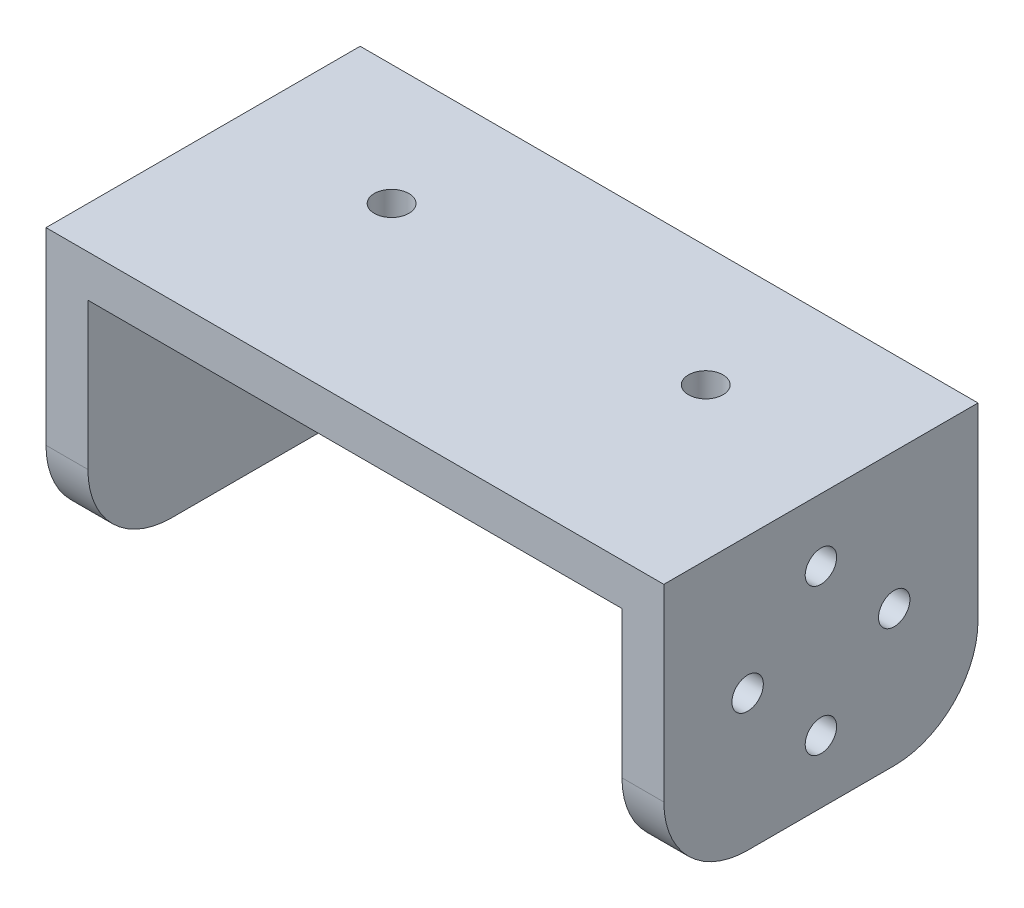
ISO-10303-21;
HEADER;
FILE_DESCRIPTION(('STEP AP214'),'2;1');
FILE_NAME('part.step','',(''),(''),'','','');
FILE_SCHEMA(('AUTOMOTIVE_DESIGN { 1 0 10303 214 1 1 1 1 }'));
ENDSEC;
DATA;
#1=APPLICATION_CONTEXT('core data for automotive mechanical design processes');
#2=APPLICATION_PROTOCOL_DEFINITION('international standard','automotive_design',2000,#1);
#3=PRODUCT_CONTEXT('',#1,'mechanical');
#4=PRODUCT('Part','Part','',(#3));
#5=PRODUCT_RELATED_PRODUCT_CATEGORY('part','',(#4));
#6=PRODUCT_DEFINITION_FORMATION('','',#4);
#7=PRODUCT_DEFINITION_CONTEXT('part definition',#1,'design');
#8=PRODUCT_DEFINITION('design','',#6,#7);
#9=PRODUCT_DEFINITION_SHAPE('','',#8);
#10=(LENGTH_UNIT() NAMED_UNIT(*) SI_UNIT(.MILLI.,.METRE.));
#11=(NAMED_UNIT(*) PLANE_ANGLE_UNIT() SI_UNIT($,.RADIAN.));
#12=(NAMED_UNIT(*) SI_UNIT($,.STERADIAN.) SOLID_ANGLE_UNIT());
#13=UNCERTAINTY_MEASURE_WITH_UNIT(LENGTH_MEASURE(1.E-05),#10,'distance_accuracy_value','');
#14=(GEOMETRIC_REPRESENTATION_CONTEXT(3) GLOBAL_UNCERTAINTY_ASSIGNED_CONTEXT((#13)) GLOBAL_UNIT_ASSIGNED_CONTEXT((#10,
#11,#12)) REPRESENTATION_CONTEXT('',''));
#15=CARTESIAN_POINT('',(0.,0.,0.));
#16=DIRECTION('',(0.,0.,1.));
#17=DIRECTION('',(1.,0.,0.));
#18=AXIS2_PLACEMENT_3D('',#15,#16,#17);
#19=CARTESIAN_POINT('',(29.5,0.,30.));
#20=DIRECTION('',(-1.,0.,0.));
#21=DIRECTION('',(0.,0.,1.));
#22=AXIS2_PLACEMENT_3D('',#19,#20,#21);
#23=PLANE('',#22);
#24=CARTESIAN_POINT('',(29.5,-13.,8.));
#25=DIRECTION('',(1.,0.,0.));
#26=DIRECTION('',(0.,0.,-1.));
#27=AXIS2_PLACEMENT_3D('',#24,#25,#26);
#28=CIRCLE('',#27,1.5);
#29=CARTESIAN_POINT('',(29.5,-13.,6.5));
#30=VERTEX_POINT('',#29);
#31=EDGE_CURVE('E207',#30,#30,#28,.T.);
#32=ORIENTED_EDGE('',*,*,#31,.F.);
#33=EDGE_LOOP('',(#32));
#34=FACE_BOUND('',#33,.T.);
#35=CARTESIAN_POINT('',(29.5,-20.,15.));
#36=DIRECTION('',(1.,0.,0.));
#37=DIRECTION('',(0.,0.,-1.));
#38=AXIS2_PLACEMENT_3D('',#35,#36,#37);
#39=CIRCLE('',#38,1.5);
#40=CARTESIAN_POINT('',(29.5,-20.,13.5));
#41=VERTEX_POINT('',#40);
#42=EDGE_CURVE('E470',#41,#41,#39,.T.);
#43=ORIENTED_EDGE('',*,*,#42,.F.);
#44=EDGE_LOOP('',(#43));
#45=FACE_BOUND('',#44,.T.);
#46=CARTESIAN_POINT('',(29.5,-13.,22.));
#47=DIRECTION('',(1.,0.,0.));
#48=DIRECTION('',(0.,0.,-1.));
#49=AXIS2_PLACEMENT_3D('',#46,#47,#48);
#50=CIRCLE('',#49,1.5);
#51=CARTESIAN_POINT('',(29.5,-13.,20.5));
#52=VERTEX_POINT('',#51);
#53=EDGE_CURVE('E473',#52,#52,#50,.T.);
#54=ORIENTED_EDGE('',*,*,#53,.F.);
#55=EDGE_LOOP('',(#54));
#56=FACE_BOUND('',#55,.T.);
#57=CARTESIAN_POINT('',(29.5,-6.,15.));
#58=DIRECTION('',(1.,0.,0.));
#59=DIRECTION('',(0.,0.,-1.));
#60=AXIS2_PLACEMENT_3D('',#57,#58,#59);
#61=CIRCLE('',#60,1.5);
#62=CARTESIAN_POINT('',(29.5,-6.,13.5));
#63=VERTEX_POINT('',#62);
#64=EDGE_CURVE('E222',#63,#63,#61,.T.);
#65=ORIENTED_EDGE('',*,*,#64,.F.);
#66=EDGE_LOOP('',(#65));
#67=FACE_BOUND('',#66,.T.);
#68=DIRECTION('',(0.,0.,-1.));
#69=VECTOR('',#68,1.);
#70=CARTESIAN_POINT('',(29.5,-26.,30.));
#71=LINE('',#70,#69);
#72=CARTESIAN_POINT('',(29.5,-26.,22.));
#73=VERTEX_POINT('',#72);
#74=CARTESIAN_POINT('',(29.5,-26.,8.));
#75=VERTEX_POINT('',#74);
#76=EDGE_CURVE('E235',#73,#75,#71,.T.);
#77=ORIENTED_EDGE('',*,*,#76,.T.);
#78=CARTESIAN_POINT('',(29.5,-18.,8.));
#79=DIRECTION('',(-1.,0.,0.));
#80=DIRECTION('',(0.,0.,1.));
#81=AXIS2_PLACEMENT_3D('',#78,#79,#80);
#82=CIRCLE('',#81,8.);
#83=CARTESIAN_POINT('',(29.5,-18.,0.));
#84=VERTEX_POINT('',#83);
#85=EDGE_CURVE('E188',#75,#84,#82,.F.);
#86=ORIENTED_EDGE('',*,*,#85,.T.);
#87=DIRECTION('',(0.,1.,0.));
#88=VECTOR('',#87,1.);
#89=CARTESIAN_POINT('',(29.5,0.,0.));
#90=LINE('',#89,#88);
#91=CARTESIAN_POINT('',(29.5,0.,0.));
#92=VERTEX_POINT('',#91);
#93=EDGE_CURVE('E154',#84,#92,#90,.T.);
#94=ORIENTED_EDGE('',*,*,#93,.T.);
#95=DIRECTION('',(0.,0.,-1.));
#96=VECTOR('',#95,1.);
#97=CARTESIAN_POINT('',(29.5,0.,30.));
#98=LINE('',#97,#96);
#99=CARTESIAN_POINT('',(29.5,0.,30.));
#100=VERTEX_POINT('',#99);
#101=EDGE_CURVE('E146',#100,#92,#98,.T.);
#102=ORIENTED_EDGE('',*,*,#101,.F.);
#103=DIRECTION('',(0.,1.,0.));
#104=VECTOR('',#103,1.);
#105=CARTESIAN_POINT('',(29.5,0.,30.));
#106=LINE('',#105,#104);
#107=CARTESIAN_POINT('',(29.5,-18.,30.));
#108=VERTEX_POINT('',#107);
#109=EDGE_CURVE('E130',#108,#100,#106,.T.);
#110=ORIENTED_EDGE('',*,*,#109,.F.);
#111=CARTESIAN_POINT('',(29.5,-18.,22.));
#112=DIRECTION('',(-1.,0.,0.));
#113=DIRECTION('',(0.,0.,1.));
#114=AXIS2_PLACEMENT_3D('',#111,#112,#113);
#115=CIRCLE('',#114,8.);
#116=EDGE_CURVE('E186',#108,#73,#115,.F.);
#117=ORIENTED_EDGE('',*,*,#116,.T.);
#118=EDGE_LOOP('',(#77,#86,#94,#102,#110,#117));
#119=FACE_BOUND('',#118,.T.);
#120=ADVANCED_FACE('F39',(#34,#45,#56,#67,#119),#23,.F.);
#121=CARTESIAN_POINT('',(0.,0.,30.));
#122=DIRECTION('',(0.,-1.,0.));
#123=DIRECTION('',(1.,0.,0.));
#124=AXIS2_PLACEMENT_3D('',#121,#122,#123);
#125=PLANE('',#124);
#126=CARTESIAN_POINT('',(15.,0.,11.5));
#127=DIRECTION('',(0.,1.,0.));
#128=DIRECTION('',(-1.,0.,0.));
#129=AXIS2_PLACEMENT_3D('',#126,#127,#128);
#130=CIRCLE('',#129,1.65000000000001);
#131=CARTESIAN_POINT('',(13.35,0.,11.5));
#132=VERTEX_POINT('',#131);
#133=EDGE_CURVE('E195',#132,#132,#130,.T.);
#134=ORIENTED_EDGE('',*,*,#133,.F.);
#135=EDGE_LOOP('',(#134));
#136=FACE_BOUND('',#135,.T.);
#137=CARTESIAN_POINT('',(-15.,0.,11.5));
#138=DIRECTION('',(0.,1.,0.));
#139=DIRECTION('',(-1.,0.,0.));
#140=AXIS2_PLACEMENT_3D('',#137,#138,#139);
#141=CIRCLE('',#140,1.65);
#142=CARTESIAN_POINT('',(-16.65,0.,11.5));
#143=VERTEX_POINT('',#142);
#144=EDGE_CURVE('E201',#143,#143,#141,.T.);
#145=ORIENTED_EDGE('',*,*,#144,.F.);
#146=EDGE_LOOP('',(#145));
#147=FACE_BOUND('',#146,.T.);
#148=DIRECTION('',(-1.,0.,0.));
#149=VECTOR('',#148,1.);
#150=CARTESIAN_POINT('',(0.,0.,0.));
#151=LINE('',#150,#149);
#152=CARTESIAN_POINT('',(-29.5,0.,0.));
#153=VERTEX_POINT('',#152);
#154=EDGE_CURVE('E237',#92,#153,#151,.T.);
#155=ORIENTED_EDGE('',*,*,#154,.T.);
#156=DIRECTION('',(0.,0.,-1.));
#157=VECTOR('',#156,1.);
#158=CARTESIAN_POINT('',(-29.5,0.,30.));
#159=LINE('',#158,#157);
#160=CARTESIAN_POINT('',(-29.5,0.,30.));
#161=VERTEX_POINT('',#160);
#162=EDGE_CURVE('E148',#161,#153,#159,.T.);
#163=ORIENTED_EDGE('',*,*,#162,.F.);
#164=DIRECTION('',(-1.,0.,0.));
#165=VECTOR('',#164,1.);
#166=CARTESIAN_POINT('',(0.,0.,30.));
#167=LINE('',#166,#165);
#168=EDGE_CURVE('E134',#100,#161,#167,.T.);
#169=ORIENTED_EDGE('',*,*,#168,.F.);
#170=ORIENTED_EDGE('',*,*,#101,.T.);
#171=EDGE_LOOP('',(#155,#163,#169,#170));
#172=FACE_BOUND('',#171,.T.);
#173=ADVANCED_FACE('F145',(#136,#147,#172),#125,.F.);
#174=CARTESIAN_POINT('',(-29.5,0.,30.));
#175=DIRECTION('',(1.,0.,0.));
#176=DIRECTION('',(0.,1.,0.));
#177=AXIS2_PLACEMENT_3D('',#174,#175,#176);
#178=PLANE('',#177);
#179=CARTESIAN_POINT('',(-29.5,-13.,15.));
#180=DIRECTION('',(-1.,0.,0.));
#181=DIRECTION('',(0.,-1.,0.));
#182=AXIS2_PLACEMENT_3D('',#179,#180,#181);
#183=CIRCLE('',#182,1.65);
#184=CARTESIAN_POINT('',(-29.5,-14.65,15.));
#185=VERTEX_POINT('',#184);
#186=EDGE_CURVE('E202',#185,#185,#183,.T.);
#187=ORIENTED_EDGE('',*,*,#186,.F.);
#188=EDGE_LOOP('',(#187));
#189=FACE_BOUND('',#188,.T.);
#190=DIRECTION('',(0.,0.,-1.));
#191=VECTOR('',#190,1.);
#192=CARTESIAN_POINT('',(-29.5,-26.,30.));
#193=LINE('',#192,#191);
#194=CARTESIAN_POINT('',(-29.5,-26.,22.));
#195=VERTEX_POINT('',#194);
#196=CARTESIAN_POINT('',(-29.5,-26.,8.));
#197=VERTEX_POINT('',#196);
#198=EDGE_CURVE('E159',#195,#197,#193,.T.);
#199=ORIENTED_EDGE('',*,*,#198,.F.);
#200=CARTESIAN_POINT('',(-29.5,-18.,22.));
#201=DIRECTION('',(1.,0.,0.));
#202=DIRECTION('',(0.,1.,0.));
#203=AXIS2_PLACEMENT_3D('',#200,#201,#202);
#204=CIRCLE('',#203,8.);
#205=CARTESIAN_POINT('',(-29.5,-18.,30.));
#206=VERTEX_POINT('',#205);
#207=EDGE_CURVE('E176',#195,#206,#204,.F.);
#208=ORIENTED_EDGE('',*,*,#207,.T.);
#209=DIRECTION('',(0.,-1.,0.));
#210=VECTOR('',#209,1.);
#211=CARTESIAN_POINT('',(-29.5,0.,30.));
#212=LINE('',#211,#210);
#213=EDGE_CURVE('E150',#161,#206,#212,.T.);
#214=ORIENTED_EDGE('',*,*,#213,.F.);
#215=ORIENTED_EDGE('',*,*,#162,.T.);
#216=DIRECTION('',(0.,-1.,0.));
#217=VECTOR('',#216,1.);
#218=CARTESIAN_POINT('',(-29.5,0.,0.));
#219=LINE('',#218,#217);
#220=CARTESIAN_POINT('',(-29.5,-18.,0.));
#221=VERTEX_POINT('',#220);
#222=EDGE_CURVE('E239',#153,#221,#219,.T.);
#223=ORIENTED_EDGE('',*,*,#222,.T.);
#224=CARTESIAN_POINT('',(-29.5,-18.,8.));
#225=DIRECTION('',(1.,0.,0.));
#226=DIRECTION('',(0.,1.,0.));
#227=AXIS2_PLACEMENT_3D('',#224,#225,#226);
#228=CIRCLE('',#227,8.);
#229=EDGE_CURVE('E174',#221,#197,#228,.F.);
#230=ORIENTED_EDGE('',*,*,#229,.T.);
#231=EDGE_LOOP('',(#199,#208,#214,#215,#223,#230));
#232=FACE_BOUND('',#231,.T.);
#233=ADVANCED_FACE('F288',(#189,#232),#178,.F.);
#234=CARTESIAN_POINT('',(-25.5,-26.,30.));
#235=DIRECTION('',(0.,1.,0.));
#236=DIRECTION('',(0.,0.,1.));
#237=AXIS2_PLACEMENT_3D('',#234,#235,#236);
#238=PLANE('',#237);
#239=DIRECTION('',(0.,0.,-1.));
#240=VECTOR('',#239,1.);
#241=CARTESIAN_POINT('',(-25.5,-26.,30.));
#242=LINE('',#241,#240);
#243=CARTESIAN_POINT('',(-25.5,-26.,22.));
#244=VERTEX_POINT('',#243);
#245=CARTESIAN_POINT('',(-25.5,-26.,8.));
#246=VERTEX_POINT('',#245);
#247=EDGE_CURVE('E256',#244,#246,#242,.T.);
#248=ORIENTED_EDGE('',*,*,#247,.F.);
#249=DIRECTION('',(1.,0.,0.));
#250=VECTOR('',#249,1.);
#251=CARTESIAN_POINT('',(-29.5,-26.,22.));
#252=LINE('',#251,#250);
#253=EDGE_CURVE('E172',#244,#195,#252,.F.);
#254=ORIENTED_EDGE('',*,*,#253,.T.);
#255=ORIENTED_EDGE('',*,*,#198,.T.);
#256=DIRECTION('',(1.,0.,0.));
#257=VECTOR('',#256,1.);
#258=CARTESIAN_POINT('',(-25.5,-26.,8.));
#259=LINE('',#258,#257);
#260=EDGE_CURVE('E169',#197,#246,#259,.T.);
#261=ORIENTED_EDGE('',*,*,#260,.T.);
#262=EDGE_LOOP('',(#248,#254,#255,#261));
#263=FACE_BOUND('',#262,.T.);
#264=ADVANCED_FACE('F263',(#263),#238,.F.);
#265=CARTESIAN_POINT('',(-25.5,-4.00000000000001,30.));
#266=DIRECTION('',(-1.,0.,0.));
#267=DIRECTION('',(0.,0.,1.));
#268=AXIS2_PLACEMENT_3D('',#265,#266,#267);
#269=PLANE('',#268);
#270=CARTESIAN_POINT('',(-25.5,-13.,15.));
#271=DIRECTION('',(-1.,0.,0.));
#272=DIRECTION('',(0.,0.,1.));
#273=AXIS2_PLACEMENT_3D('',#270,#271,#272);
#274=CIRCLE('',#273,1.65);
#275=CARTESIAN_POINT('',(-25.5,-13.,16.65));
#276=VERTEX_POINT('',#275);
#277=EDGE_CURVE('E198',#276,#276,#274,.T.);
#278=ORIENTED_EDGE('',*,*,#277,.T.);
#279=EDGE_LOOP('',(#278));
#280=FACE_BOUND('',#279,.T.);
#281=DIRECTION('',(0.,1.,0.));
#282=VECTOR('',#281,1.);
#283=CARTESIAN_POINT('',(-25.5,-4.00000000000001,30.));
#284=LINE('',#283,#282);
#285=CARTESIAN_POINT('',(-25.5,-18.,30.));
#286=VERTEX_POINT('',#285);
#287=CARTESIAN_POINT('',(-25.5,-4.00000000000001,30.));
#288=VERTEX_POINT('',#287);
#289=EDGE_CURVE('E229',#286,#288,#284,.T.);
#290=ORIENTED_EDGE('',*,*,#289,.F.);
#291=CARTESIAN_POINT('',(-25.5,-18.,22.));
#292=DIRECTION('',(-1.,0.,0.));
#293=DIRECTION('',(0.,0.,1.));
#294=AXIS2_PLACEMENT_3D('',#291,#292,#293);
#295=CIRCLE('',#294,8.);
#296=EDGE_CURVE('E167',#286,#244,#295,.F.);
#297=ORIENTED_EDGE('',*,*,#296,.T.);
#298=ORIENTED_EDGE('',*,*,#247,.T.);
#299=CARTESIAN_POINT('',(-25.5,-18.,8.));
#300=DIRECTION('',(-1.,0.,0.));
#301=DIRECTION('',(0.,0.,1.));
#302=AXIS2_PLACEMENT_3D('',#299,#300,#301);
#303=CIRCLE('',#302,8.);
#304=CARTESIAN_POINT('',(-25.5,-18.,0.));
#305=VERTEX_POINT('',#304);
#306=EDGE_CURVE('E165',#246,#305,#303,.F.);
#307=ORIENTED_EDGE('',*,*,#306,.T.);
#308=DIRECTION('',(0.,1.,0.));
#309=VECTOR('',#308,1.);
#310=CARTESIAN_POINT('',(-25.5,-4.00000000000001,0.));
#311=LINE('',#310,#309);
#312=CARTESIAN_POINT('',(-25.5,-4.00000000000001,0.));
#313=VERTEX_POINT('',#312);
#314=EDGE_CURVE('E242',#305,#313,#311,.T.);
#315=ORIENTED_EDGE('',*,*,#314,.T.);
#316=DIRECTION('',(0.,0.,-1.));
#317=VECTOR('',#316,1.);
#318=CARTESIAN_POINT('',(-25.5,-4.00000000000001,30.));
#319=LINE('',#318,#317);
#320=EDGE_CURVE('E253',#288,#313,#319,.T.);
#321=ORIENTED_EDGE('',*,*,#320,.F.);
#322=EDGE_LOOP('',(#290,#297,#298,#307,#315,#321));
#323=FACE_BOUND('',#322,.T.);
#324=ADVANCED_FACE('F274',(#280,#323),#269,.F.);
#325=CARTESIAN_POINT('',(0.,-4.,30.));
#326=DIRECTION('',(0.,1.,0.));
#327=DIRECTION('',(0.,0.,1.));
#328=AXIS2_PLACEMENT_3D('',#325,#326,#327);
#329=PLANE('',#328);
#330=CARTESIAN_POINT('',(15.,-4.,11.5));
#331=DIRECTION('',(0.,1.,0.));
#332=DIRECTION('',(0.,0.,1.));
#333=AXIS2_PLACEMENT_3D('',#330,#331,#332);
#334=CIRCLE('',#333,1.65000000000001);
#335=CARTESIAN_POINT('',(15.,-4.,13.15));
#336=VERTEX_POINT('',#335);
#337=EDGE_CURVE('E194',#336,#336,#334,.T.);
#338=ORIENTED_EDGE('',*,*,#337,.T.);
#339=EDGE_LOOP('',(#338));
#340=FACE_BOUND('',#339,.T.);
#341=CARTESIAN_POINT('',(-15.,-4.,11.5));
#342=DIRECTION('',(0.,1.,0.));
#343=DIRECTION('',(0.,0.,1.));
#344=AXIS2_PLACEMENT_3D('',#341,#342,#343);
#345=CIRCLE('',#344,1.65);
#346=CARTESIAN_POINT('',(-15.,-4.,13.15));
#347=VERTEX_POINT('',#346);
#348=EDGE_CURVE('E191',#347,#347,#345,.T.);
#349=ORIENTED_EDGE('',*,*,#348,.T.);
#350=EDGE_LOOP('',(#349));
#351=FACE_BOUND('',#350,.T.);
#352=DIRECTION('',(1.,0.,0.));
#353=VECTOR('',#352,1.);
#354=CARTESIAN_POINT('',(0.,-4.,0.));
#355=LINE('',#354,#353);
#356=CARTESIAN_POINT('',(25.5,-4.,0.));
#357=VERTEX_POINT('',#356);
#358=EDGE_CURVE('E244',#313,#357,#355,.T.);
#359=ORIENTED_EDGE('',*,*,#358,.T.);
#360=DIRECTION('',(0.,0.,-1.));
#361=VECTOR('',#360,1.);
#362=CARTESIAN_POINT('',(25.5,-4.,30.));
#363=LINE('',#362,#361);
#364=CARTESIAN_POINT('',(25.5,-4.,30.));
#365=VERTEX_POINT('',#364);
#366=EDGE_CURVE('E250',#365,#357,#363,.T.);
#367=ORIENTED_EDGE('',*,*,#366,.F.);
#368=DIRECTION('',(1.,0.,0.));
#369=VECTOR('',#368,1.);
#370=CARTESIAN_POINT('',(0.,-4.,30.));
#371=LINE('',#370,#369);
#372=EDGE_CURVE('E231',#288,#365,#371,.T.);
#373=ORIENTED_EDGE('',*,*,#372,.F.);
#374=ORIENTED_EDGE('',*,*,#320,.T.);
#375=EDGE_LOOP('',(#359,#367,#373,#374));
#376=FACE_BOUND('',#375,.T.);
#377=ADVANCED_FACE('F284',(#340,#351,#376),#329,.F.);
#378=CARTESIAN_POINT('',(25.5,-4.,30.));
#379=DIRECTION('',(1.,0.,0.));
#380=DIRECTION('',(0.,1.,0.));
#381=AXIS2_PLACEMENT_3D('',#378,#379,#380);
#382=PLANE('',#381);
#383=CARTESIAN_POINT('',(25.5,-13.,8.));
#384=DIRECTION('',(1.,0.,0.));
#385=DIRECTION('',(0.,1.,0.));
#386=AXIS2_PLACEMENT_3D('',#383,#384,#385);
#387=CIRCLE('',#386,1.5);
#388=CARTESIAN_POINT('',(25.5,-11.5,8.));
#389=VERTEX_POINT('',#388);
#390=EDGE_CURVE('E43',#389,#389,#387,.T.);
#391=ORIENTED_EDGE('',*,*,#390,.T.);
#392=EDGE_LOOP('',(#391));
#393=FACE_BOUND('',#392,.T.);
#394=CARTESIAN_POINT('',(25.5,-20.,15.));
#395=DIRECTION('',(1.,0.,0.));
#396=DIRECTION('',(0.,1.,0.));
#397=AXIS2_PLACEMENT_3D('',#394,#395,#396);
#398=CIRCLE('',#397,1.5);
#399=CARTESIAN_POINT('',(25.5,-18.5,15.));
#400=VERTEX_POINT('',#399);
#401=EDGE_CURVE('E209',#400,#400,#398,.T.);
#402=ORIENTED_EDGE('',*,*,#401,.T.);
#403=EDGE_LOOP('',(#402));
#404=FACE_BOUND('',#403,.T.);
#405=CARTESIAN_POINT('',(25.5,-13.,22.));
#406=DIRECTION('',(1.,0.,0.));
#407=DIRECTION('',(0.,1.,0.));
#408=AXIS2_PLACEMENT_3D('',#405,#406,#407);
#409=CIRCLE('',#408,1.5);
#410=CARTESIAN_POINT('',(25.5,-11.5,22.));
#411=VERTEX_POINT('',#410);
#412=EDGE_CURVE('E206',#411,#411,#409,.T.);
#413=ORIENTED_EDGE('',*,*,#412,.T.);
#414=EDGE_LOOP('',(#413));
#415=FACE_BOUND('',#414,.T.);
#416=CARTESIAN_POINT('',(25.5,-6.,15.));
#417=DIRECTION('',(1.,0.,0.));
#418=DIRECTION('',(0.,1.,0.));
#419=AXIS2_PLACEMENT_3D('',#416,#417,#418);
#420=CIRCLE('',#419,1.5);
#421=CARTESIAN_POINT('',(25.5,-4.5,15.));
#422=VERTEX_POINT('',#421);
#423=EDGE_CURVE('E203',#422,#422,#420,.T.);
#424=ORIENTED_EDGE('',*,*,#423,.T.);
#425=EDGE_LOOP('',(#424));
#426=FACE_BOUND('',#425,.T.);
#427=DIRECTION('',(0.,-1.,0.));
#428=VECTOR('',#427,1.);
#429=CARTESIAN_POINT('',(25.5,-4.,0.));
#430=LINE('',#429,#428);
#431=CARTESIAN_POINT('',(25.5,-18.,0.));
#432=VERTEX_POINT('',#431);
#433=EDGE_CURVE('E141',#357,#432,#430,.T.);
#434=ORIENTED_EDGE('',*,*,#433,.T.);
#435=CARTESIAN_POINT('',(25.5,-18.,8.));
#436=DIRECTION('',(1.,0.,0.));
#437=DIRECTION('',(0.,1.,0.));
#438=AXIS2_PLACEMENT_3D('',#435,#436,#437);
#439=CIRCLE('',#438,8.);
#440=CARTESIAN_POINT('',(25.5,-26.,8.));
#441=VERTEX_POINT('',#440);
#442=EDGE_CURVE('E11',#432,#441,#439,.F.);
#443=ORIENTED_EDGE('',*,*,#442,.T.);
#444=DIRECTION('',(0.,0.,-1.));
#445=VECTOR('',#444,1.);
#446=CARTESIAN_POINT('',(25.5,-26.,30.));
#447=LINE('',#446,#445);
#448=CARTESIAN_POINT('',(25.5,-26.,22.));
#449=VERTEX_POINT('',#448);
#450=EDGE_CURVE('E248',#449,#441,#447,.T.);
#451=ORIENTED_EDGE('',*,*,#450,.F.);
#452=CARTESIAN_POINT('',(25.5,-18.,22.));
#453=DIRECTION('',(1.,0.,0.));
#454=DIRECTION('',(0.,1.,0.));
#455=AXIS2_PLACEMENT_3D('',#452,#453,#454);
#456=CIRCLE('',#455,8.);
#457=CARTESIAN_POINT('',(25.5,-18.,30.));
#458=VERTEX_POINT('',#457);
#459=EDGE_CURVE('E48',#449,#458,#456,.F.);
#460=ORIENTED_EDGE('',*,*,#459,.T.);
#461=DIRECTION('',(0.,-1.,0.));
#462=VECTOR('',#461,1.);
#463=CARTESIAN_POINT('',(25.5,-4.,30.));
#464=LINE('',#463,#462);
#465=EDGE_CURVE('E233',#365,#458,#464,.T.);
#466=ORIENTED_EDGE('',*,*,#465,.F.);
#467=ORIENTED_EDGE('',*,*,#366,.T.);
#468=EDGE_LOOP('',(#434,#443,#451,#460,#466,#467));
#469=FACE_BOUND('',#468,.T.);
#470=ADVANCED_FACE('F297',(#393,#404,#415,#426,#469),#382,.F.);
#471=CARTESIAN_POINT('',(25.5,-26.,30.));
#472=DIRECTION('',(0.,1.,0.));
#473=DIRECTION('',(0.,0.,1.));
#474=AXIS2_PLACEMENT_3D('',#471,#472,#473);
#475=PLANE('',#474);
#476=ORIENTED_EDGE('',*,*,#450,.T.);
#477=DIRECTION('',(1.,0.,0.));
#478=VECTOR('',#477,1.);
#479=CARTESIAN_POINT('',(25.5,-26.,8.));
#480=LINE('',#479,#478);
#481=EDGE_CURVE('E183',#441,#75,#480,.T.);
#482=ORIENTED_EDGE('',*,*,#481,.T.);
#483=ORIENTED_EDGE('',*,*,#76,.F.);
#484=DIRECTION('',(1.,0.,0.));
#485=VECTOR('',#484,1.);
#486=CARTESIAN_POINT('',(25.5,-26.,22.));
#487=LINE('',#486,#485);
#488=EDGE_CURVE('E61',#73,#449,#487,.F.);
#489=ORIENTED_EDGE('',*,*,#488,.T.);
#490=EDGE_LOOP('',(#476,#482,#483,#489));
#491=FACE_BOUND('',#490,.T.);
#492=ADVANCED_FACE('F293',(#491),#475,.F.);
#493=CARTESIAN_POINT('',(0.,0.,30.));
#494=DIRECTION('',(0.,0.,1.));
#495=DIRECTION('',(1.,0.,0.));
#496=AXIS2_PLACEMENT_3D('',#493,#494,#495);
#497=PLANE('',#496);
#498=ORIENTED_EDGE('',*,*,#213,.T.);
#499=DIRECTION('',(1.,0.,0.));
#500=VECTOR('',#499,1.);
#501=CARTESIAN_POINT('',(-25.5,-18.,30.));
#502=LINE('',#501,#500);
#503=EDGE_CURVE('E157',#206,#286,#502,.T.);
#504=ORIENTED_EDGE('',*,*,#503,.T.);
#505=ORIENTED_EDGE('',*,*,#289,.T.);
#506=ORIENTED_EDGE('',*,*,#372,.T.);
#507=ORIENTED_EDGE('',*,*,#465,.T.);
#508=DIRECTION('',(1.,0.,0.));
#509=VECTOR('',#508,1.);
#510=CARTESIAN_POINT('',(29.5,-18.,30.));
#511=LINE('',#510,#509);
#512=EDGE_CURVE('E138',#458,#108,#511,.T.);
#513=ORIENTED_EDGE('',*,*,#512,.T.);
#514=ORIENTED_EDGE('',*,*,#109,.T.);
#515=ORIENTED_EDGE('',*,*,#168,.T.);
#516=EDGE_LOOP('',(#498,#504,#505,#506,#507,#513,#514,#515));
#517=FACE_BOUND('',#516,.T.);
#518=ADVANCED_FACE('F133',(#517),#497,.T.);
#519=CARTESIAN_POINT('',(0.,0.,0.));
#520=DIRECTION('',(0.,0.,1.));
#521=DIRECTION('',(1.,0.,0.));
#522=AXIS2_PLACEMENT_3D('',#519,#520,#521);
#523=PLANE('',#522);
#524=ORIENTED_EDGE('',*,*,#314,.F.);
#525=DIRECTION('',(1.,0.,0.));
#526=VECTOR('',#525,1.);
#527=CARTESIAN_POINT('',(0.,-18.,0.));
#528=LINE('',#527,#526);
#529=EDGE_CURVE('E180',#305,#221,#528,.F.);
#530=ORIENTED_EDGE('',*,*,#529,.T.);
#531=ORIENTED_EDGE('',*,*,#222,.F.);
#532=ORIENTED_EDGE('',*,*,#154,.F.);
#533=ORIENTED_EDGE('',*,*,#93,.F.);
#534=DIRECTION('',(1.,0.,0.));
#535=VECTOR('',#534,1.);
#536=CARTESIAN_POINT('',(0.,-18.,0.));
#537=LINE('',#536,#535);
#538=EDGE_CURVE('E178',#84,#432,#537,.F.);
#539=ORIENTED_EDGE('',*,*,#538,.T.);
#540=ORIENTED_EDGE('',*,*,#433,.F.);
#541=ORIENTED_EDGE('',*,*,#358,.F.);
#542=EDGE_LOOP('',(#524,#530,#531,#532,#533,#539,#540,#541));
#543=FACE_BOUND('',#542,.T.);
#544=ADVANCED_FACE('F278',(#543),#523,.F.);
#545=CARTESIAN_POINT('',(0.,-18.,22.));
#546=DIRECTION('',(-1.,0.,0.));
#547=DIRECTION('',(0.,0.,1.));
#548=AXIS2_PLACEMENT_3D('',#545,#546,#547);
#549=CYLINDRICAL_SURFACE('',#548,8.);
#550=ORIENTED_EDGE('',*,*,#207,.F.);
#551=ORIENTED_EDGE('',*,*,#253,.F.);
#552=ORIENTED_EDGE('',*,*,#296,.F.);
#553=ORIENTED_EDGE('',*,*,#503,.F.);
#554=EDGE_LOOP('',(#550,#551,#552,#553));
#555=FACE_BOUND('',#554,.T.);
#556=ADVANCED_FACE('F287',(#555),#549,.T.);
#557=CARTESIAN_POINT('',(-25.5,-18.,8.));
#558=DIRECTION('',(1.,0.,0.));
#559=DIRECTION('',(0.,0.,-1.));
#560=AXIS2_PLACEMENT_3D('',#557,#558,#559);
#561=CYLINDRICAL_SURFACE('',#560,8.);
#562=ORIENTED_EDGE('',*,*,#229,.F.);
#563=ORIENTED_EDGE('',*,*,#529,.F.);
#564=ORIENTED_EDGE('',*,*,#306,.F.);
#565=ORIENTED_EDGE('',*,*,#260,.F.);
#566=EDGE_LOOP('',(#562,#563,#564,#565));
#567=FACE_BOUND('',#566,.T.);
#568=ADVANCED_FACE('F269',(#567),#561,.T.);
#569=CARTESIAN_POINT('',(25.5,-18.,8.));
#570=DIRECTION('',(1.,0.,0.));
#571=DIRECTION('',(0.,0.,-1.));
#572=AXIS2_PLACEMENT_3D('',#569,#570,#571);
#573=CYLINDRICAL_SURFACE('',#572,8.);
#574=ORIENTED_EDGE('',*,*,#442,.F.);
#575=ORIENTED_EDGE('',*,*,#538,.F.);
#576=ORIENTED_EDGE('',*,*,#85,.F.);
#577=ORIENTED_EDGE('',*,*,#481,.F.);
#578=EDGE_LOOP('',(#574,#575,#576,#577));
#579=FACE_BOUND('',#578,.T.);
#580=ADVANCED_FACE('F291',(#579),#573,.T.);
#581=CARTESIAN_POINT('',(0.,-18.,22.));
#582=DIRECTION('',(-1.,0.,0.));
#583=DIRECTION('',(0.,0.,1.));
#584=AXIS2_PLACEMENT_3D('',#581,#582,#583);
#585=CYLINDRICAL_SURFACE('',#584,8.);
#586=ORIENTED_EDGE('',*,*,#459,.F.);
#587=ORIENTED_EDGE('',*,*,#488,.F.);
#588=ORIENTED_EDGE('',*,*,#116,.F.);
#589=ORIENTED_EDGE('',*,*,#512,.F.);
#590=EDGE_LOOP('',(#586,#587,#588,#589));
#591=FACE_BOUND('',#590,.T.);
#592=ADVANCED_FACE('F41',(#591),#585,.T.);
#593=CARTESIAN_POINT('',(-15.,-10.,11.5));
#594=DIRECTION('',(0.,1.,0.));
#595=DIRECTION('',(-1.,0.,0.));
#596=AXIS2_PLACEMENT_3D('',#593,#594,#595);
#597=CYLINDRICAL_SURFACE('',#596,1.65);
#598=ORIENTED_EDGE('',*,*,#144,.T.);
#599=EDGE_LOOP('',(#598));
#600=FACE_BOUND('',#599,.T.);
#601=ORIENTED_EDGE('',*,*,#348,.F.);
#602=EDGE_LOOP('',(#601));
#603=FACE_BOUND('',#602,.T.);
#604=ADVANCED_FACE('F326',(#600,#603),#597,.F.);
#605=CARTESIAN_POINT('',(15.,-10.,11.5));
#606=DIRECTION('',(0.,1.,0.));
#607=DIRECTION('',(-1.,0.,0.));
#608=AXIS2_PLACEMENT_3D('',#605,#606,#607);
#609=CYLINDRICAL_SURFACE('',#608,1.65000000000001);
#610=ORIENTED_EDGE('',*,*,#133,.T.);
#611=EDGE_LOOP('',(#610));
#612=FACE_BOUND('',#611,.T.);
#613=ORIENTED_EDGE('',*,*,#337,.F.);
#614=EDGE_LOOP('',(#613));
#615=FACE_BOUND('',#614,.T.);
#616=ADVANCED_FACE('F330',(#612,#615),#609,.F.);
#617=CARTESIAN_POINT('',(-19.5,-13.,15.));
#618=DIRECTION('',(-1.,0.,0.));
#619=DIRECTION('',(0.,-1.,0.));
#620=AXIS2_PLACEMENT_3D('',#617,#618,#619);
#621=CYLINDRICAL_SURFACE('',#620,1.65);
#622=ORIENTED_EDGE('',*,*,#186,.T.);
#623=EDGE_LOOP('',(#622));
#624=FACE_BOUND('',#623,.T.);
#625=ORIENTED_EDGE('',*,*,#277,.F.);
#626=EDGE_LOOP('',(#625));
#627=FACE_BOUND('',#626,.T.);
#628=ADVANCED_FACE('F336',(#624,#627),#621,.F.);
#629=CARTESIAN_POINT('',(19.5,-6.,15.));
#630=DIRECTION('',(1.,0.,0.));
#631=DIRECTION('',(0.,0.,-1.));
#632=AXIS2_PLACEMENT_3D('',#629,#630,#631);
#633=CYLINDRICAL_SURFACE('',#632,1.5);
#634=ORIENTED_EDGE('',*,*,#64,.T.);
#635=EDGE_LOOP('',(#634));
#636=FACE_BOUND('',#635,.T.);
#637=ORIENTED_EDGE('',*,*,#423,.F.);
#638=EDGE_LOOP('',(#637));
#639=FACE_BOUND('',#638,.T.);
#640=ADVANCED_FACE('F417',(#636,#639),#633,.F.);
#641=CARTESIAN_POINT('',(19.5,-13.,22.));
#642=DIRECTION('',(1.,0.,0.));
#643=DIRECTION('',(0.,0.,-1.));
#644=AXIS2_PLACEMENT_3D('',#641,#642,#643);
#645=CYLINDRICAL_SURFACE('',#644,1.5);
#646=ORIENTED_EDGE('',*,*,#53,.T.);
#647=EDGE_LOOP('',(#646));
#648=FACE_BOUND('',#647,.T.);
#649=ORIENTED_EDGE('',*,*,#412,.F.);
#650=EDGE_LOOP('',(#649));
#651=FACE_BOUND('',#650,.T.);
#652=ADVANCED_FACE('F434',(#648,#651),#645,.F.);
#653=CARTESIAN_POINT('',(19.5,-20.,15.));
#654=DIRECTION('',(1.,0.,0.));
#655=DIRECTION('',(0.,0.,-1.));
#656=AXIS2_PLACEMENT_3D('',#653,#654,#655);
#657=CYLINDRICAL_SURFACE('',#656,1.5);
#658=ORIENTED_EDGE('',*,*,#42,.T.);
#659=EDGE_LOOP('',(#658));
#660=FACE_BOUND('',#659,.T.);
#661=ORIENTED_EDGE('',*,*,#401,.F.);
#662=EDGE_LOOP('',(#661));
#663=FACE_BOUND('',#662,.T.);
#664=ADVANCED_FACE('F444',(#660,#663),#657,.F.);
#665=CARTESIAN_POINT('',(19.5,-13.,8.));
#666=DIRECTION('',(1.,0.,0.));
#667=DIRECTION('',(0.,0.,-1.));
#668=AXIS2_PLACEMENT_3D('',#665,#666,#667);
#669=CYLINDRICAL_SURFACE('',#668,1.5);
#670=ORIENTED_EDGE('',*,*,#31,.T.);
#671=EDGE_LOOP('',(#670));
#672=FACE_BOUND('',#671,.T.);
#673=ORIENTED_EDGE('',*,*,#390,.F.);
#674=EDGE_LOOP('',(#673));
#675=FACE_BOUND('',#674,.T.);
#676=ADVANCED_FACE('F454',(#672,#675),#669,.F.);
#677=CLOSED_SHELL('',(#120,#173,#233,#264,#324,#377,#470,#492,#518,#544,#556,#568,#580,#592,
#604,#616,#628,#640,#652,#664,#676));
#678=MANIFOLD_SOLID_BREP('B2',#677);
#679=ADVANCED_BREP_SHAPE_REPRESENTATION('',(#18,#678),#14);
#680=SHAPE_DEFINITION_REPRESENTATION(#9,#679);
ENDSEC;
END-ISO-10303-21;
